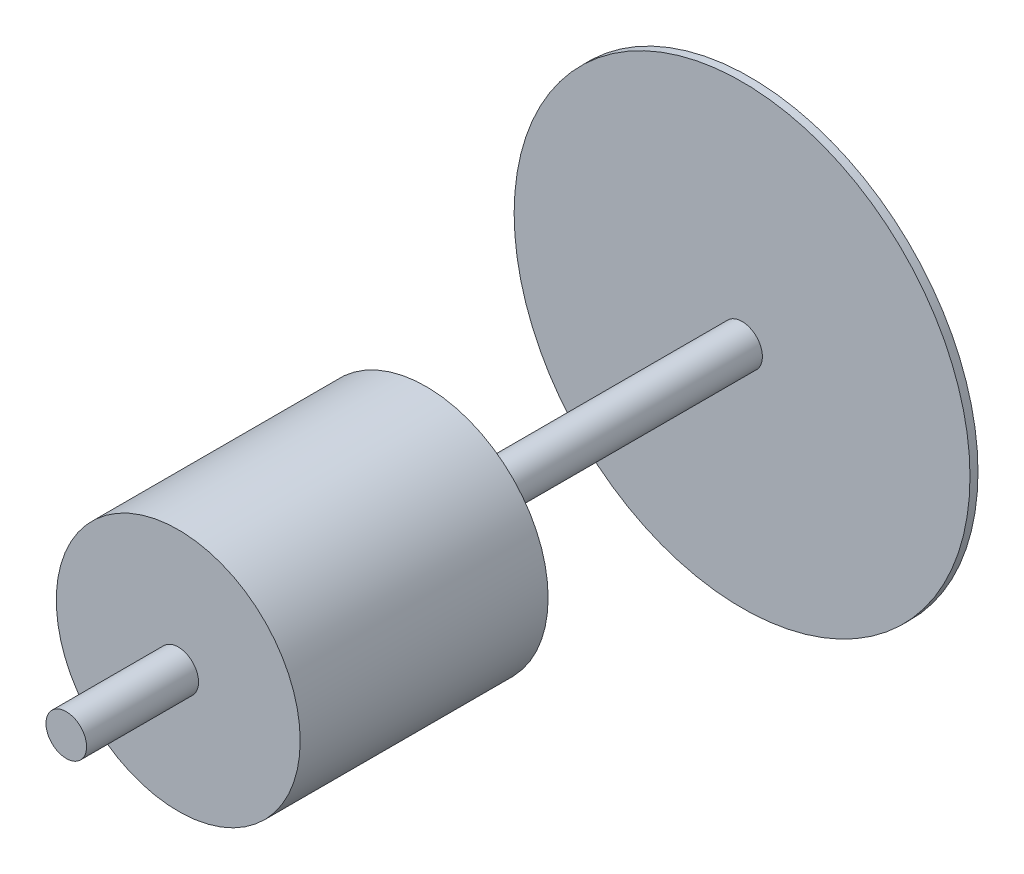
ISO-10303-21;
HEADER;
FILE_DESCRIPTION(('STEP AP214'),'2;1');
FILE_NAME('part.step','',(''),(''),'','','');
FILE_SCHEMA(('AUTOMOTIVE_DESIGN { 1 0 10303 214 1 1 1 1 }'));
ENDSEC;
DATA;
#1=APPLICATION_CONTEXT('core data for automotive mechanical design processes');
#2=APPLICATION_PROTOCOL_DEFINITION('international standard','automotive_design',2000,#1);
#3=PRODUCT_CONTEXT('',#1,'mechanical');
#4=PRODUCT('Part','Part','',(#3));
#5=PRODUCT_RELATED_PRODUCT_CATEGORY('part','',(#4));
#6=PRODUCT_DEFINITION_FORMATION('','',#4);
#7=PRODUCT_DEFINITION_CONTEXT('part definition',#1,'design');
#8=PRODUCT_DEFINITION('design','',#6,#7);
#9=PRODUCT_DEFINITION_SHAPE('','',#8);
#10=(LENGTH_UNIT() NAMED_UNIT(*) SI_UNIT(.MILLI.,.METRE.));
#11=(NAMED_UNIT(*) PLANE_ANGLE_UNIT() SI_UNIT($,.RADIAN.));
#12=(NAMED_UNIT(*) SI_UNIT($,.STERADIAN.) SOLID_ANGLE_UNIT());
#13=UNCERTAINTY_MEASURE_WITH_UNIT(LENGTH_MEASURE(1.E-05),#10,'distance_accuracy_value','');
#14=(GEOMETRIC_REPRESENTATION_CONTEXT(3) GLOBAL_UNCERTAINTY_ASSIGNED_CONTEXT((#13)) GLOBAL_UNIT_ASSIGNED_CONTEXT((#10,
#11,#12)) REPRESENTATION_CONTEXT('',''));
#15=CARTESIAN_POINT('',(0.,0.,0.));
#16=DIRECTION('',(0.,0.,1.));
#17=DIRECTION('',(1.,0.,0.));
#18=AXIS2_PLACEMENT_3D('',#15,#16,#17);
#19=CARTESIAN_POINT('',(0.,0.,130.));
#20=DIRECTION('',(0.,0.,1.));
#21=DIRECTION('',(1.,0.,0.));
#22=AXIS2_PLACEMENT_3D('',#19,#20,#21);
#23=CYLINDRICAL_SURFACE('',#22,305.);
#24=CARTESIAN_POINT('',(0.,0.,130.));
#25=DIRECTION('',(0.,0.,1.));
#26=DIRECTION('',(1.,0.,0.));
#27=AXIS2_PLACEMENT_3D('',#24,#25,#26);
#28=CIRCLE('',#27,305.);
#29=CARTESIAN_POINT('',(305.,0.,130.));
#30=VERTEX_POINT('',#29);
#31=EDGE_CURVE('E67',#30,#30,#28,.T.);
#32=ORIENTED_EDGE('',*,*,#31,.T.);
#33=EDGE_LOOP('',(#32));
#34=FACE_BOUND('',#33,.T.);
#35=CARTESIAN_POINT('',(0.,0.,750.));
#36=DIRECTION('',(0.,0.,1.));
#37=DIRECTION('',(1.,0.,0.));
#38=AXIS2_PLACEMENT_3D('',#35,#36,#37);
#39=CIRCLE('',#38,305.);
#40=CARTESIAN_POINT('',(305.,0.,750.));
#41=VERTEX_POINT('',#40);
#42=EDGE_CURVE('E78',#41,#41,#39,.T.);
#43=ORIENTED_EDGE('',*,*,#42,.F.);
#44=EDGE_LOOP('',(#43));
#45=FACE_BOUND('',#44,.T.);
#46=ADVANCED_FACE('F45',(#34,#45),#23,.T.);
#47=CARTESIAN_POINT('',(0.,0.,130.));
#48=DIRECTION('',(0.,0.,1.));
#49=DIRECTION('',(1.,0.,0.));
#50=AXIS2_PLACEMENT_3D('',#47,#48,#49);
#51=PLANE('',#50);
#52=CARTESIAN_POINT('',(0.,0.,130.));
#53=DIRECTION('',(0.,0.,1.));
#54=DIRECTION('',(1.,0.,0.));
#55=AXIS2_PLACEMENT_3D('',#52,#53,#54);
#56=CIRCLE('',#55,225.);
#57=CARTESIAN_POINT('',(225.,0.,130.));
#58=VERTEX_POINT('',#57);
#59=EDGE_CURVE('E10',#58,#58,#56,.F.);
#60=ORIENTED_EDGE('',*,*,#59,.F.);
#61=EDGE_LOOP('',(#60));
#62=FACE_BOUND('',#61,.T.);
#63=ORIENTED_EDGE('',*,*,#31,.F.);
#64=EDGE_LOOP('',(#63));
#65=FACE_BOUND('',#64,.T.);
#66=ADVANCED_FACE('F113',(#62,#65),#51,.F.);
#67=CARTESIAN_POINT('',(0.,0.,750.));
#68=DIRECTION('',(0.,0.,1.));
#69=DIRECTION('',(1.,0.,0.));
#70=AXIS2_PLACEMENT_3D('',#67,#68,#69);
#71=PLANE('',#70);
#72=CARTESIAN_POINT('',(0.,0.,750.));
#73=DIRECTION('',(0.,0.,1.));
#74=DIRECTION('',(1.,0.,0.));
#75=AXIS2_PLACEMENT_3D('',#72,#73,#74);
#76=CIRCLE('',#75,50.8);
#77=CARTESIAN_POINT('',(50.8,0.,750.));
#78=VERTEX_POINT('',#77);
#79=EDGE_CURVE('E62',#78,#78,#76,.T.);
#80=ORIENTED_EDGE('',*,*,#79,.F.);
#81=EDGE_LOOP('',(#80));
#82=FACE_BOUND('',#81,.T.);
#83=ORIENTED_EDGE('',*,*,#42,.T.);
#84=EDGE_LOOP('',(#83));
#85=FACE_BOUND('',#84,.T.);
#86=ADVANCED_FACE('F120',(#82,#85),#71,.T.);
#87=CARTESIAN_POINT('',(0.,0.,1030.));
#88=DIRECTION('',(0.,0.,1.));
#89=DIRECTION('',(1.,0.,0.));
#90=AXIS2_PLACEMENT_3D('',#87,#88,#89);
#91=PLANE('',#90);
#92=CARTESIAN_POINT('',(0.,0.,1030.));
#93=DIRECTION('',(0.,0.,1.));
#94=DIRECTION('',(1.,0.,0.));
#95=AXIS2_PLACEMENT_3D('',#92,#93,#94);
#96=CIRCLE('',#95,50.8);
#97=CARTESIAN_POINT('',(50.8,0.,1030.));
#98=VERTEX_POINT('',#97);
#99=EDGE_CURVE('E54',#98,#98,#96,.T.);
#100=ORIENTED_EDGE('',*,*,#99,.T.);
#101=EDGE_LOOP('',(#100));
#102=FACE_BOUND('',#101,.T.);
#103=ADVANCED_FACE('F132',(#102),#91,.T.);
#104=CARTESIAN_POINT('',(0.,0.,1030.));
#105=DIRECTION('',(0.,0.,-1.));
#106=DIRECTION('',(-1.,0.,0.));
#107=AXIS2_PLACEMENT_3D('',#104,#105,#106);
#108=CYLINDRICAL_SURFACE('',#107,50.8);
#109=ORIENTED_EDGE('',*,*,#79,.T.);
#110=EDGE_LOOP('',(#109));
#111=FACE_BOUND('',#110,.T.);
#112=ORIENTED_EDGE('',*,*,#99,.F.);
#113=EDGE_LOOP('',(#112));
#114=FACE_BOUND('',#113,.T.);
#115=ADVANCED_FACE('F47',(#111,#114),#108,.T.);
#116=CARTESIAN_POINT('',(0.,0.,80.));
#117=DIRECTION('',(0.,0.,1.));
#118=DIRECTION('',(1.,0.,0.));
#119=AXIS2_PLACEMENT_3D('',#116,#117,#118);
#120=CYLINDRICAL_SURFACE('',#119,225.);
#121=CARTESIAN_POINT('',(0.,0.,80.));
#122=DIRECTION('',(0.,0.,-1.));
#123=DIRECTION('',(-1.,0.,0.));
#124=AXIS2_PLACEMENT_3D('',#121,#122,#123);
#125=CIRCLE('',#124,225.);
#126=CARTESIAN_POINT('',(-225.,0.,80.));
#127=VERTEX_POINT('',#126);
#128=EDGE_CURVE('E85',#127,#127,#125,.T.);
#129=ORIENTED_EDGE('',*,*,#128,.F.);
#130=EDGE_LOOP('',(#129));
#131=FACE_BOUND('',#130,.T.);
#132=ORIENTED_EDGE('',*,*,#59,.T.);
#133=EDGE_LOOP('',(#132));
#134=FACE_BOUND('',#133,.T.);
#135=ADVANCED_FACE('F100',(#131,#134),#120,.T.);
#136=CARTESIAN_POINT('',(0.,0.,80.));
#137=DIRECTION('',(0.,0.,-1.));
#138=DIRECTION('',(-1.,0.,0.));
#139=AXIS2_PLACEMENT_3D('',#136,#137,#138);
#140=PLANE('',#139);
#141=CARTESIAN_POINT('',(0.,0.,80.));
#142=DIRECTION('',(0.,0.,-1.));
#143=DIRECTION('',(-1.,0.,0.));
#144=AXIS2_PLACEMENT_3D('',#141,#142,#143);
#145=CIRCLE('',#144,50.8);
#146=CARTESIAN_POINT('',(-50.8,0.,80.));
#147=VERTEX_POINT('',#146);
#148=EDGE_CURVE('E49',#147,#147,#145,.T.);
#149=ORIENTED_EDGE('',*,*,#148,.F.);
#150=EDGE_LOOP('',(#149));
#151=FACE_BOUND('',#150,.T.);
#152=ORIENTED_EDGE('',*,*,#128,.T.);
#153=EDGE_LOOP('',(#152));
#154=FACE_BOUND('',#153,.T.);
#155=ADVANCED_FACE('F97',(#151,#154),#140,.T.);
#156=CARTESIAN_POINT('',(0.,0.,-680.));
#157=DIRECTION('',(0.,0.,1.));
#158=DIRECTION('',(1.,0.,0.));
#159=AXIS2_PLACEMENT_3D('',#156,#157,#158);
#160=PLANE('',#159);
#161=CARTESIAN_POINT('',(0.,0.,-680.));
#162=DIRECTION('',(0.,0.,1.));
#163=DIRECTION('',(1.,0.,0.));
#164=AXIS2_PLACEMENT_3D('',#161,#162,#163);
#165=CIRCLE('',#164,570.);
#166=CARTESIAN_POINT('',(570.,0.,-680.));
#167=VERTEX_POINT('',#166);
#168=EDGE_CURVE('E66',#167,#167,#165,.T.);
#169=ORIENTED_EDGE('',*,*,#168,.F.);
#170=EDGE_LOOP('',(#169));
#171=FACE_BOUND('',#170,.T.);
#172=ADVANCED_FACE('F99',(#171),#160,.F.);
#173=CARTESIAN_POINT('',(0.,0.,-660.));
#174=DIRECTION('',(0.,0.,-1.));
#175=DIRECTION('',(-1.,0.,0.));
#176=AXIS2_PLACEMENT_3D('',#173,#174,#175);
#177=CYLINDRICAL_SURFACE('',#176,570.);
#178=CARTESIAN_POINT('',(0.,0.,-660.));
#179=DIRECTION('',(0.,0.,1.));
#180=DIRECTION('',(1.,0.,0.));
#181=AXIS2_PLACEMENT_3D('',#178,#179,#180);
#182=CIRCLE('',#181,570.);
#183=CARTESIAN_POINT('',(570.,0.,-660.));
#184=VERTEX_POINT('',#183);
#185=EDGE_CURVE('E70',#184,#184,#182,.T.);
#186=ORIENTED_EDGE('',*,*,#185,.F.);
#187=EDGE_LOOP('',(#186));
#188=FACE_BOUND('',#187,.T.);
#189=ORIENTED_EDGE('',*,*,#168,.T.);
#190=EDGE_LOOP('',(#189));
#191=FACE_BOUND('',#190,.T.);
#192=ADVANCED_FACE('F107',(#188,#191),#177,.T.);
#193=CARTESIAN_POINT('',(0.,0.,-660.));
#194=DIRECTION('',(0.,0.,1.));
#195=DIRECTION('',(1.,0.,0.));
#196=AXIS2_PLACEMENT_3D('',#193,#194,#195);
#197=PLANE('',#196);
#198=CARTESIAN_POINT('',(0.,0.,-660.));
#199=DIRECTION('',(0.,0.,1.));
#200=DIRECTION('',(1.,0.,0.));
#201=AXIS2_PLACEMENT_3D('',#198,#199,#200);
#202=CIRCLE('',#201,50.8);
#203=CARTESIAN_POINT('',(50.8,0.,-660.));
#204=VERTEX_POINT('',#203);
#205=EDGE_CURVE('E59',#204,#204,#202,.T.);
#206=ORIENTED_EDGE('',*,*,#205,.F.);
#207=EDGE_LOOP('',(#206));
#208=FACE_BOUND('',#207,.T.);
#209=ORIENTED_EDGE('',*,*,#185,.T.);
#210=EDGE_LOOP('',(#209));
#211=FACE_BOUND('',#210,.T.);
#212=ADVANCED_FACE('F126',(#208,#211),#197,.T.);
#213=ORIENTED_EDGE('',*,*,#148,.T.);
#214=EDGE_LOOP('',(#213));
#215=FACE_BOUND('',#214,.T.);
#216=ORIENTED_EDGE('',*,*,#205,.T.);
#217=EDGE_LOOP('',(#216));
#218=FACE_BOUND('',#217,.T.);
#219=ADVANCED_FACE('F94',(#215,#218),#108,.T.);
#220=CLOSED_SHELL('',(#46,#66,#86,#103,#115,#135,#155,#172,#192,#212,#219));
#221=MANIFOLD_SOLID_BREP('B2',#220);
#222=ADVANCED_BREP_SHAPE_REPRESENTATION('',(#18,#221),#14);
#223=SHAPE_DEFINITION_REPRESENTATION(#9,#222);
ENDSEC;
END-ISO-10303-21;
